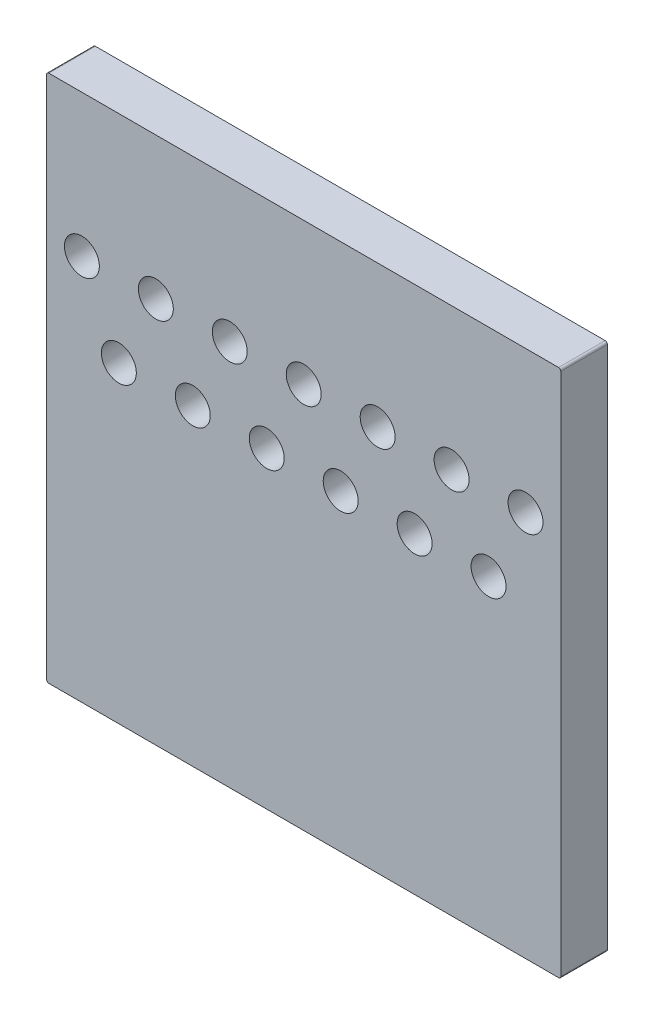
ISO-10303-21;
HEADER;
FILE_DESCRIPTION(('STEP AP214'),'2;1');
FILE_NAME('part.step','',(''),(''),'','','');
FILE_SCHEMA(('AUTOMOTIVE_DESIGN { 1 0 10303 214 1 1 1 1 }'));
ENDSEC;
DATA;
#1=APPLICATION_CONTEXT('core data for automotive mechanical design processes');
#2=APPLICATION_PROTOCOL_DEFINITION('international standard','automotive_design',2000,#1);
#3=PRODUCT_CONTEXT('',#1,'mechanical');
#4=PRODUCT('Part','Part','',(#3));
#5=PRODUCT_RELATED_PRODUCT_CATEGORY('part','',(#4));
#6=PRODUCT_DEFINITION_FORMATION('','',#4);
#7=PRODUCT_DEFINITION_CONTEXT('part definition',#1,'design');
#8=PRODUCT_DEFINITION('design','',#6,#7);
#9=PRODUCT_DEFINITION_SHAPE('','',#8);
#10=(LENGTH_UNIT() NAMED_UNIT(*) SI_UNIT(.MILLI.,.METRE.));
#11=(NAMED_UNIT(*) PLANE_ANGLE_UNIT() SI_UNIT($,.RADIAN.));
#12=(NAMED_UNIT(*) SI_UNIT($,.STERADIAN.) SOLID_ANGLE_UNIT());
#13=UNCERTAINTY_MEASURE_WITH_UNIT(LENGTH_MEASURE(1.E-05),#10,'distance_accuracy_value','');
#14=(GEOMETRIC_REPRESENTATION_CONTEXT(3) GLOBAL_UNCERTAINTY_ASSIGNED_CONTEXT((#13)) GLOBAL_UNIT_ASSIGNED_CONTEXT((#10,
#11,#12)) REPRESENTATION_CONTEXT('',''));
#15=CARTESIAN_POINT('',(0.,0.,0.));
#16=DIRECTION('',(0.,0.,1.));
#17=DIRECTION('',(1.,0.,0.));
#18=AXIS2_PLACEMENT_3D('',#15,#16,#17);
#19=CARTESIAN_POINT('',(28.913000106812,77.287002563477,0.80000094));
#20=DIRECTION('',(0.,0.,1.));
#21=DIRECTION('',(1.,0.,0.));
#22=AXIS2_PLACEMENT_3D('',#19,#20,#21);
#23=PLANE('',#22);
#24=CARTESIAN_POINT('',(35.83092656,83.92519918,0.80000094));
#25=DIRECTION('',(0.,0.,-1.));
#26=DIRECTION('',(-1.,0.,0.));
#27=AXIS2_PLACEMENT_3D('',#24,#25,#26);
#28=CIRCLE('',#27,0.2999994);
#29=CARTESIAN_POINT('',(35.53092716,83.92519918,0.80000094));
#30=VERTEX_POINT('',#29);
#31=EDGE_CURVE('E163',#30,#30,#28,.T.);
#32=ORIENTED_EDGE('',*,*,#31,.T.);
#33=EDGE_LOOP('',(#32));
#34=FACE_BOUND('',#33,.T.);
#35=CARTESIAN_POINT('',(37.10092656,83.92519918,0.80000094));
#36=DIRECTION('',(0.,0.,-1.));
#37=DIRECTION('',(-1.,0.,0.));
#38=AXIS2_PLACEMENT_3D('',#35,#36,#37);
#39=CIRCLE('',#38,0.2999994);
#40=CARTESIAN_POINT('',(36.80092716,83.92519918,0.80000094));
#41=VERTEX_POINT('',#40);
#42=EDGE_CURVE('E166',#41,#41,#39,.T.);
#43=ORIENTED_EDGE('',*,*,#42,.T.);
#44=EDGE_LOOP('',(#43));
#45=FACE_BOUND('',#44,.T.);
#46=CARTESIAN_POINT('',(33.29092656,83.92519918,0.80000094));
#47=DIRECTION('',(0.,0.,-1.));
#48=DIRECTION('',(-1.,0.,0.));
#49=AXIS2_PLACEMENT_3D('',#46,#47,#48);
#50=CIRCLE('',#49,0.2999994);
#51=CARTESIAN_POINT('',(32.99092716,83.92519918,0.80000094));
#52=VERTEX_POINT('',#51);
#53=EDGE_CURVE('E169',#52,#52,#50,.T.);
#54=ORIENTED_EDGE('',*,*,#53,.T.);
#55=EDGE_LOOP('',(#54));
#56=FACE_BOUND('',#55,.T.);
#57=CARTESIAN_POINT('',(34.56092656,83.92519918,0.80000094));
#58=DIRECTION('',(0.,0.,-1.));
#59=DIRECTION('',(-1.,0.,0.));
#60=AXIS2_PLACEMENT_3D('',#57,#58,#59);
#61=CIRCLE('',#60,0.2999994);
#62=CARTESIAN_POINT('',(34.26092716,83.92519918,0.80000094));
#63=VERTEX_POINT('',#62);
#64=EDGE_CURVE('E172',#63,#63,#61,.T.);
#65=ORIENTED_EDGE('',*,*,#64,.T.);
#66=EDGE_LOOP('',(#65));
#67=FACE_BOUND('',#66,.T.);
#68=CARTESIAN_POINT('',(35.19592656,82.65519918,0.80000094));
#69=DIRECTION('',(0.,0.,-1.));
#70=DIRECTION('',(-1.,0.,0.));
#71=AXIS2_PLACEMENT_3D('',#68,#69,#70);
#72=CIRCLE('',#71,0.2999994);
#73=CARTESIAN_POINT('',(34.89592716,82.65519918,0.80000094));
#74=VERTEX_POINT('',#73);
#75=EDGE_CURVE('E175',#74,#74,#72,.T.);
#76=ORIENTED_EDGE('',*,*,#75,.T.);
#77=EDGE_LOOP('',(#76));
#78=FACE_BOUND('',#77,.T.);
#79=CARTESIAN_POINT('',(36.46592656,82.65519918,0.80000094));
#80=DIRECTION('',(0.,0.,-1.));
#81=DIRECTION('',(-1.,0.,0.));
#82=AXIS2_PLACEMENT_3D('',#79,#80,#81);
#83=CIRCLE('',#82,0.2999994);
#84=CARTESIAN_POINT('',(36.16592716,82.65519918,0.80000094));
#85=VERTEX_POINT('',#84);
#86=EDGE_CURVE('E178',#85,#85,#83,.T.);
#87=ORIENTED_EDGE('',*,*,#86,.T.);
#88=EDGE_LOOP('',(#87));
#89=FACE_BOUND('',#88,.T.);
#90=CARTESIAN_POINT('',(33.92592656,82.65519918,0.80000094));
#91=DIRECTION('',(0.,0.,-1.));
#92=DIRECTION('',(-1.,0.,0.));
#93=AXIS2_PLACEMENT_3D('',#90,#91,#92);
#94=CIRCLE('',#93,0.2999994);
#95=CARTESIAN_POINT('',(33.62592716,82.65519918,0.80000094));
#96=VERTEX_POINT('',#95);
#97=EDGE_CURVE('E181',#96,#96,#94,.T.);
#98=ORIENTED_EDGE('',*,*,#97,.T.);
#99=EDGE_LOOP('',(#98));
#100=FACE_BOUND('',#99,.T.);
#101=CARTESIAN_POINT('',(30.75092656,83.92519918,0.80000094));
#102=DIRECTION('',(0.,0.,-1.));
#103=DIRECTION('',(-1.,0.,0.));
#104=AXIS2_PLACEMENT_3D('',#101,#102,#103);
#105=CIRCLE('',#104,0.2999994);
#106=CARTESIAN_POINT('',(30.45092716,83.92519918,0.80000094));
#107=VERTEX_POINT('',#106);
#108=EDGE_CURVE('E184',#107,#107,#105,.T.);
#109=ORIENTED_EDGE('',*,*,#108,.T.);
#110=EDGE_LOOP('',(#109));
#111=FACE_BOUND('',#110,.T.);
#112=CARTESIAN_POINT('',(32.02092656,83.92519918,0.80000094));
#113=DIRECTION('',(0.,0.,-1.));
#114=DIRECTION('',(-1.,0.,0.));
#115=AXIS2_PLACEMENT_3D('',#112,#113,#114);
#116=CIRCLE('',#115,0.2999994);
#117=CARTESIAN_POINT('',(31.72092716,83.92519918,0.80000094));
#118=VERTEX_POINT('',#117);
#119=EDGE_CURVE('E187',#118,#118,#116,.T.);
#120=ORIENTED_EDGE('',*,*,#119,.T.);
#121=EDGE_LOOP('',(#120));
#122=FACE_BOUND('',#121,.T.);
#123=CARTESIAN_POINT('',(29.48092656,83.92519918,0.80000094));
#124=DIRECTION('',(0.,0.,-1.));
#125=DIRECTION('',(-1.,0.,0.));
#126=AXIS2_PLACEMENT_3D('',#123,#124,#125);
#127=CIRCLE('',#126,0.2999994);
#128=CARTESIAN_POINT('',(29.18092716,83.92519918,0.80000094));
#129=VERTEX_POINT('',#128);
#130=EDGE_CURVE('E190',#129,#129,#127,.T.);
#131=ORIENTED_EDGE('',*,*,#130,.T.);
#132=EDGE_LOOP('',(#131));
#133=FACE_BOUND('',#132,.T.);
#134=CARTESIAN_POINT('',(31.38592656,82.65519918,0.80000094));
#135=DIRECTION('',(0.,0.,-1.));
#136=DIRECTION('',(-1.,0.,0.));
#137=AXIS2_PLACEMENT_3D('',#134,#135,#136);
#138=CIRCLE('',#137,0.2999994);
#139=CARTESIAN_POINT('',(31.08592716,82.65519918,0.80000094));
#140=VERTEX_POINT('',#139);
#141=EDGE_CURVE('E193',#140,#140,#138,.T.);
#142=ORIENTED_EDGE('',*,*,#141,.T.);
#143=EDGE_LOOP('',(#142));
#144=FACE_BOUND('',#143,.T.);
#145=CARTESIAN_POINT('',(32.65592656,82.65519918,0.80000094));
#146=DIRECTION('',(0.,0.,-1.));
#147=DIRECTION('',(-1.,0.,0.));
#148=AXIS2_PLACEMENT_3D('',#145,#146,#147);
#149=CIRCLE('',#148,0.2999994);
#150=CARTESIAN_POINT('',(32.35592716,82.65519918,0.80000094));
#151=VERTEX_POINT('',#150);
#152=EDGE_CURVE('E196',#151,#151,#149,.T.);
#153=ORIENTED_EDGE('',*,*,#152,.T.);
#154=EDGE_LOOP('',(#153));
#155=FACE_BOUND('',#154,.T.);
#156=CARTESIAN_POINT('',(30.11592656,82.65519918,0.80000094));
#157=DIRECTION('',(0.,0.,-1.));
#158=DIRECTION('',(-1.,0.,0.));
#159=AXIS2_PLACEMENT_3D('',#156,#157,#158);
#160=CIRCLE('',#159,0.2999994);
#161=CARTESIAN_POINT('',(29.81592716,82.65519918,0.80000094));
#162=VERTEX_POINT('',#161);
#163=EDGE_CURVE('E199',#162,#162,#160,.T.);
#164=ORIENTED_EDGE('',*,*,#163,.T.);
#165=EDGE_LOOP('',(#164));
#166=FACE_BOUND('',#165,.T.);
#167=DIRECTION('',(0.,1.,0.));
#168=VECTOR('',#167,1.);
#169=CARTESIAN_POINT('',(28.875,77.324996948242,0.80000094));
#170=LINE('',#169,#168);
#171=CARTESIAN_POINT('',(28.8749999999997,77.324996948242,0.80000094));
#172=VERTEX_POINT('',#171);
#173=CARTESIAN_POINT('',(28.875,86.324996948242,0.80000094));
#174=VERTEX_POINT('',#173);
#175=EDGE_CURVE('E107',#172,#174,#170,.T.);
#176=ORIENTED_EDGE('',*,*,#175,.F.);
#177=CARTESIAN_POINT('',(28.912551896545,77.324554392951,0.80000094));
#178=DIRECTION('',(0.,0.,-1.));
#179=DIRECTION('',(-1.,0.,0.));
#180=AXIS2_PLACEMENT_3D('',#177,#178,#179);
#181=CIRCLE('',#180,0.03755450424843);
#182=CARTESIAN_POINT('',(28.913000106812,77.2870025634766,0.80000094));
#183=VERTEX_POINT('',#182);
#184=EDGE_CURVE('E94',#183,#172,#181,.T.);
#185=ORIENTED_EDGE('',*,*,#184,.F.);
#186=DIRECTION('',(1.,0.,0.));
#187=VECTOR('',#186,1.);
#188=CARTESIAN_POINT('',(37.667999267578,77.287002563477,0.80000094));
#189=LINE('',#188,#187);
#190=CARTESIAN_POINT('',(37.6679992675684,77.2870025634766,0.80000094));
#191=VERTEX_POINT('',#190);
#192=EDGE_CURVE('E91',#191,#183,#189,.F.);
#193=ORIENTED_EDGE('',*,*,#192,.F.);
#194=CARTESIAN_POINT('',(37.669405407789,77.324573963767,0.80000094));
#195=DIRECTION('',(0.,0.,-1.));
#196=DIRECTION('',(-1.,0.,0.));
#197=AXIS2_PLACEMENT_3D('',#194,#195,#196);
#198=CIRCLE('',#197,0.03759770405353);
#199=CARTESIAN_POINT('',(37.707000732422,77.324996948242,0.80000094));
#200=VERTEX_POINT('',#199);
#201=EDGE_CURVE('E19',#200,#191,#198,.T.);
#202=ORIENTED_EDGE('',*,*,#201,.F.);
#203=DIRECTION('',(0.,1.,0.));
#204=VECTOR('',#203,1.);
#205=CARTESIAN_POINT('',(37.707000732422,86.324996948242,0.80000094));
#206=LINE('',#205,#204);
#207=CARTESIAN_POINT('',(37.7070007324218,86.324996948242,0.80000094));
#208=VERTEX_POINT('',#207);
#209=EDGE_CURVE('E78',#208,#200,#206,.F.);
#210=ORIENTED_EDGE('',*,*,#209,.F.);
#211=CARTESIAN_POINT('',(37.667746185972,86.324743866636,0.80000094));
#212=DIRECTION('',(0.,0.,-1.));
#213=DIRECTION('',(-1.,0.,0.));
#214=AXIS2_PLACEMENT_3D('',#211,#212,#213);
#215=CIRCLE('',#214,0.0392553622741);
#216=CARTESIAN_POINT('',(37.667999267578,86.363998413086,0.80000094));
#217=VERTEX_POINT('',#216);
#218=EDGE_CURVE('E205',#217,#208,#215,.T.);
#219=ORIENTED_EDGE('',*,*,#218,.F.);
#220=DIRECTION('',(1.,0.,0.));
#221=VECTOR('',#220,1.);
#222=CARTESIAN_POINT('',(28.913000106812,86.363998413086,0.80000094));
#223=LINE('',#222,#221);
#224=CARTESIAN_POINT('',(28.9130001068087,86.3639984130861,0.80000094));
#225=VERTEX_POINT('',#224);
#226=EDGE_CURVE('E111',#225,#217,#223,.T.);
#227=ORIENTED_EDGE('',*,*,#226,.F.);
#228=CARTESIAN_POINT('',(28.914285161577,86.324733390264,0.80000094));
#229=DIRECTION('',(0.,0.,-1.));
#230=DIRECTION('',(-1.,0.,0.));
#231=AXIS2_PLACEMENT_3D('',#228,#229,#230);
#232=CIRCLE('',#231,0.03928604565208);
#233=EDGE_CURVE('E204',#174,#225,#232,.T.);
#234=ORIENTED_EDGE('',*,*,#233,.F.);
#235=EDGE_LOOP('',(#176,#185,#193,#202,#210,#219,#227,#234));
#236=FACE_BOUND('',#235,.T.);
#237=ADVANCED_FACE('F16',(#34,#45,#56,#67,#78,#89,#100,#111,#122,#133,#144,#155,#166,#236),#23,.T.);
#238=CARTESIAN_POINT('',(37.667999267578,77.287002563477,0.));
#239=DIRECTION('',(0.,-1.,0.));
#240=DIRECTION('',(0.,0.,-1.));
#241=AXIS2_PLACEMENT_3D('',#238,#239,#240);
#242=PLANE('',#241);
#243=DIRECTION('',(0.,0.,-1.));
#244=VECTOR('',#243,1.);
#245=CARTESIAN_POINT('',(28.913000106812,77.2870025634762,0.));
#246=LINE('',#245,#244);
#247=CARTESIAN_POINT('',(28.913000106812,77.2870025634766,0.));
#248=VERTEX_POINT('',#247);
#249=EDGE_CURVE('E203',#248,#183,#246,.F.);
#250=ORIENTED_EDGE('',*,*,#249,.F.);
#251=DIRECTION('',(1.,0.,0.));
#252=VECTOR('',#251,1.);
#253=CARTESIAN_POINT('',(28.913000106812,77.287002563477,0.));
#254=LINE('',#253,#252);
#255=CARTESIAN_POINT('',(37.6679992675684,77.2870025634766,0.));
#256=VERTEX_POINT('',#255);
#257=EDGE_CURVE('E101',#248,#256,#254,.T.);
#258=ORIENTED_EDGE('',*,*,#257,.T.);
#259=DIRECTION('',(0.,0.,-1.));
#260=VECTOR('',#259,1.);
#261=CARTESIAN_POINT('',(37.667999267578,77.2870025634763,0.));
#262=LINE('',#261,#260);
#263=EDGE_CURVE('E87',#191,#256,#262,.T.);
#264=ORIENTED_EDGE('',*,*,#263,.F.);
#265=ORIENTED_EDGE('',*,*,#192,.T.);
#266=EDGE_LOOP('',(#250,#258,#264,#265));
#267=FACE_BOUND('',#266,.T.);
#268=ADVANCED_FACE('F100',(#267),#242,.T.);
#269=CARTESIAN_POINT('',(37.669405407789,77.324573963767,0.));
#270=DIRECTION('',(0.,0.,-1.));
#271=DIRECTION('',(-1.,0.,0.));
#272=AXIS2_PLACEMENT_3D('',#269,#270,#271);
#273=CYLINDRICAL_SURFACE('',#272,0.03759770405353);
#274=ORIENTED_EDGE('',*,*,#263,.T.);
#275=CARTESIAN_POINT('',(37.669405407789,77.324573963767,0.));
#276=DIRECTION('',(0.,0.,-1.));
#277=DIRECTION('',(-1.,0.,0.));
#278=AXIS2_PLACEMENT_3D('',#275,#276,#277);
#279=CIRCLE('',#278,0.03759770405353);
#280=CARTESIAN_POINT('',(37.707000732422,77.324996948242,0.));
#281=VERTEX_POINT('',#280);
#282=EDGE_CURVE('E161',#256,#281,#279,.F.);
#283=ORIENTED_EDGE('',*,*,#282,.T.);
#284=DIRECTION('',(0.,0.,-1.));
#285=VECTOR('',#284,1.);
#286=CARTESIAN_POINT('',(37.707000732422,77.324996948242,0.));
#287=LINE('',#286,#285);
#288=EDGE_CURVE('E89',#200,#281,#287,.T.);
#289=ORIENTED_EDGE('',*,*,#288,.F.);
#290=ORIENTED_EDGE('',*,*,#201,.T.);
#291=EDGE_LOOP('',(#274,#283,#289,#290));
#292=FACE_BOUND('',#291,.T.);
#293=ADVANCED_FACE('F84',(#292),#273,.T.);
#294=CARTESIAN_POINT('',(37.707000732422,86.324996948242,0.));
#295=DIRECTION('',(1.,0.,0.));
#296=DIRECTION('',(0.,0.,-1.));
#297=AXIS2_PLACEMENT_3D('',#294,#295,#296);
#298=PLANE('',#297);
#299=ORIENTED_EDGE('',*,*,#288,.T.);
#300=DIRECTION('',(0.,1.,0.));
#301=VECTOR('',#300,1.);
#302=CARTESIAN_POINT('',(37.707000732422,77.287002563477,0.));
#303=LINE('',#302,#301);
#304=CARTESIAN_POINT('',(37.7070007324218,86.324996948242,0.));
#305=VERTEX_POINT('',#304);
#306=EDGE_CURVE('E160',#281,#305,#303,.T.);
#307=ORIENTED_EDGE('',*,*,#306,.T.);
#308=DIRECTION('',(0.,0.,-1.));
#309=VECTOR('',#308,1.);
#310=CARTESIAN_POINT('',(37.7070007324217,86.324996948242,0.));
#311=LINE('',#310,#309);
#312=EDGE_CURVE('E113',#208,#305,#311,.T.);
#313=ORIENTED_EDGE('',*,*,#312,.F.);
#314=ORIENTED_EDGE('',*,*,#209,.T.);
#315=EDGE_LOOP('',(#299,#307,#313,#314));
#316=FACE_BOUND('',#315,.T.);
#317=ADVANCED_FACE('F211',(#316),#298,.T.);
#318=CARTESIAN_POINT('',(37.667746185972,86.324743866636,0.));
#319=DIRECTION('',(0.,0.,-1.));
#320=DIRECTION('',(-1.,0.,0.));
#321=AXIS2_PLACEMENT_3D('',#318,#319,#320);
#322=CYLINDRICAL_SURFACE('',#321,0.0392553622741);
#323=ORIENTED_EDGE('',*,*,#312,.T.);
#324=CARTESIAN_POINT('',(37.667746185972,86.324743866636,0.));
#325=DIRECTION('',(0.,0.,-1.));
#326=DIRECTION('',(-1.,0.,0.));
#327=AXIS2_PLACEMENT_3D('',#324,#325,#326);
#328=CIRCLE('',#327,0.0392553622741);
#329=CARTESIAN_POINT('',(37.667999267578,86.363998413086,0.));
#330=VERTEX_POINT('',#329);
#331=EDGE_CURVE('E157',#305,#330,#328,.F.);
#332=ORIENTED_EDGE('',*,*,#331,.T.);
#333=DIRECTION('',(0.,0.,1.));
#334=VECTOR('',#333,1.);
#335=CARTESIAN_POINT('',(37.667999267578,86.363998413086,0.));
#336=LINE('',#335,#334);
#337=EDGE_CURVE('E112',#217,#330,#336,.F.);
#338=ORIENTED_EDGE('',*,*,#337,.F.);
#339=ORIENTED_EDGE('',*,*,#218,.T.);
#340=EDGE_LOOP('',(#323,#332,#338,#339));
#341=FACE_BOUND('',#340,.T.);
#342=ADVANCED_FACE('F232',(#341),#322,.T.);
#343=CARTESIAN_POINT('',(28.913000106812,86.363998413086,0.));
#344=DIRECTION('',(0.,1.,0.));
#345=DIRECTION('',(0.,0.,1.));
#346=AXIS2_PLACEMENT_3D('',#343,#344,#345);
#347=PLANE('',#346);
#348=ORIENTED_EDGE('',*,*,#337,.T.);
#349=DIRECTION('',(1.,0.,0.));
#350=VECTOR('',#349,1.);
#351=CARTESIAN_POINT('',(28.913000106812,86.363998413086,0.));
#352=LINE('',#351,#350);
#353=CARTESIAN_POINT('',(28.9130001068087,86.3639984130861,0.));
#354=VERTEX_POINT('',#353);
#355=EDGE_CURVE('E156',#330,#354,#352,.F.);
#356=ORIENTED_EDGE('',*,*,#355,.T.);
#357=DIRECTION('',(0.,0.,-1.));
#358=VECTOR('',#357,1.);
#359=CARTESIAN_POINT('',(28.913000106812,86.3639984130862,0.));
#360=LINE('',#359,#358);
#361=EDGE_CURVE('E109',#225,#354,#360,.T.);
#362=ORIENTED_EDGE('',*,*,#361,.F.);
#363=ORIENTED_EDGE('',*,*,#226,.T.);
#364=EDGE_LOOP('',(#348,#356,#362,#363));
#365=FACE_BOUND('',#364,.T.);
#366=ADVANCED_FACE('F228',(#365),#347,.T.);
#367=CARTESIAN_POINT('',(28.914285161577,86.324733390264,0.));
#368=DIRECTION('',(0.,0.,-1.));
#369=DIRECTION('',(-1.,0.,0.));
#370=AXIS2_PLACEMENT_3D('',#367,#368,#369);
#371=CYLINDRICAL_SURFACE('',#370,0.03928604565208);
#372=ORIENTED_EDGE('',*,*,#361,.T.);
#373=CARTESIAN_POINT('',(28.914285161577,86.324733390264,0.));
#374=DIRECTION('',(0.,0.,-1.));
#375=DIRECTION('',(-1.,0.,0.));
#376=AXIS2_PLACEMENT_3D('',#373,#374,#375);
#377=CIRCLE('',#376,0.03928604565208);
#378=CARTESIAN_POINT('',(28.875,86.324996948242,0.));
#379=VERTEX_POINT('',#378);
#380=EDGE_CURVE('E153',#354,#379,#377,.F.);
#381=ORIENTED_EDGE('',*,*,#380,.T.);
#382=DIRECTION('',(0.,0.,1.));
#383=VECTOR('',#382,1.);
#384=CARTESIAN_POINT('',(28.875,86.324996948242,0.));
#385=LINE('',#384,#383);
#386=EDGE_CURVE('E108',#174,#379,#385,.F.);
#387=ORIENTED_EDGE('',*,*,#386,.F.);
#388=ORIENTED_EDGE('',*,*,#233,.T.);
#389=EDGE_LOOP('',(#372,#381,#387,#388));
#390=FACE_BOUND('',#389,.T.);
#391=ADVANCED_FACE('F240',(#390),#371,.T.);
#392=CARTESIAN_POINT('',(28.875,77.324996948242,0.));
#393=DIRECTION('',(-1.,0.,0.));
#394=DIRECTION('',(0.,0.,1.));
#395=AXIS2_PLACEMENT_3D('',#392,#393,#394);
#396=PLANE('',#395);
#397=ORIENTED_EDGE('',*,*,#386,.T.);
#398=DIRECTION('',(0.,1.,0.));
#399=VECTOR('',#398,1.);
#400=CARTESIAN_POINT('',(28.875,77.287002563477,0.));
#401=LINE('',#400,#399);
#402=CARTESIAN_POINT('',(28.8749999999997,77.324996948242,0.));
#403=VERTEX_POINT('',#402);
#404=EDGE_CURVE('E152',#379,#403,#401,.F.);
#405=ORIENTED_EDGE('',*,*,#404,.T.);
#406=DIRECTION('',(0.,0.,-1.));
#407=VECTOR('',#406,1.);
#408=CARTESIAN_POINT('',(28.8749999999996,77.324996948242,0.));
#409=LINE('',#408,#407);
#410=EDGE_CURVE('E34',#172,#403,#409,.T.);
#411=ORIENTED_EDGE('',*,*,#410,.F.);
#412=ORIENTED_EDGE('',*,*,#175,.T.);
#413=EDGE_LOOP('',(#397,#405,#411,#412));
#414=FACE_BOUND('',#413,.T.);
#415=ADVANCED_FACE('F306',(#414),#396,.T.);
#416=CARTESIAN_POINT('',(28.912551896545,77.324554392951,0.));
#417=DIRECTION('',(0.,0.,-1.));
#418=DIRECTION('',(-1.,0.,0.));
#419=AXIS2_PLACEMENT_3D('',#416,#417,#418);
#420=CYLINDRICAL_SURFACE('',#419,0.03755450424843);
#421=ORIENTED_EDGE('',*,*,#410,.T.);
#422=CARTESIAN_POINT('',(28.912551896545,77.324554392951,0.));
#423=DIRECTION('',(0.,0.,-1.));
#424=DIRECTION('',(-1.,0.,0.));
#425=AXIS2_PLACEMENT_3D('',#422,#423,#424);
#426=CIRCLE('',#425,0.03755450424843);
#427=EDGE_CURVE('E150',#403,#248,#426,.F.);
#428=ORIENTED_EDGE('',*,*,#427,.T.);
#429=ORIENTED_EDGE('',*,*,#249,.T.);
#430=ORIENTED_EDGE('',*,*,#184,.T.);
#431=EDGE_LOOP('',(#421,#428,#429,#430));
#432=FACE_BOUND('',#431,.T.);
#433=ADVANCED_FACE('F302',(#432),#420,.T.);
#434=CARTESIAN_POINT('',(30.11592656,82.65519918,0.));
#435=DIRECTION('',(0.,0.,-1.));
#436=DIRECTION('',(-1.,0.,0.));
#437=AXIS2_PLACEMENT_3D('',#434,#435,#436);
#438=CYLINDRICAL_SURFACE('',#437,0.2999994);
#439=ORIENTED_EDGE('',*,*,#163,.F.);
#440=EDGE_LOOP('',(#439));
#441=FACE_BOUND('',#440,.T.);
#442=CARTESIAN_POINT('',(30.11592656,82.65519918,0.));
#443=DIRECTION('',(0.,0.,-1.));
#444=DIRECTION('',(-1.,0.,0.));
#445=AXIS2_PLACEMENT_3D('',#442,#443,#444);
#446=CIRCLE('',#445,0.2999994);
#447=CARTESIAN_POINT('',(29.81592716,82.65519918,0.));
#448=VERTEX_POINT('',#447);
#449=EDGE_CURVE('E147',#448,#448,#446,.T.);
#450=ORIENTED_EDGE('',*,*,#449,.T.);
#451=EDGE_LOOP('',(#450));
#452=FACE_BOUND('',#451,.T.);
#453=ADVANCED_FACE('F298',(#441,#452),#438,.F.);
#454=CARTESIAN_POINT('',(32.65592656,82.65519918,0.));
#455=DIRECTION('',(0.,0.,-1.));
#456=DIRECTION('',(-1.,0.,0.));
#457=AXIS2_PLACEMENT_3D('',#454,#455,#456);
#458=CYLINDRICAL_SURFACE('',#457,0.2999994);
#459=ORIENTED_EDGE('',*,*,#152,.F.);
#460=EDGE_LOOP('',(#459));
#461=FACE_BOUND('',#460,.T.);
#462=CARTESIAN_POINT('',(32.65592656,82.65519918,0.));
#463=DIRECTION('',(0.,0.,-1.));
#464=DIRECTION('',(-1.,0.,0.));
#465=AXIS2_PLACEMENT_3D('',#462,#463,#464);
#466=CIRCLE('',#465,0.2999994);
#467=CARTESIAN_POINT('',(32.35592716,82.65519918,0.));
#468=VERTEX_POINT('',#467);
#469=EDGE_CURVE('E144',#468,#468,#466,.T.);
#470=ORIENTED_EDGE('',*,*,#469,.T.);
#471=EDGE_LOOP('',(#470));
#472=FACE_BOUND('',#471,.T.);
#473=ADVANCED_FACE('F294',(#461,#472),#458,.F.);
#474=CARTESIAN_POINT('',(31.38592656,82.65519918,0.));
#475=DIRECTION('',(0.,0.,-1.));
#476=DIRECTION('',(-1.,0.,0.));
#477=AXIS2_PLACEMENT_3D('',#474,#475,#476);
#478=CYLINDRICAL_SURFACE('',#477,0.2999994);
#479=ORIENTED_EDGE('',*,*,#141,.F.);
#480=EDGE_LOOP('',(#479));
#481=FACE_BOUND('',#480,.T.);
#482=CARTESIAN_POINT('',(31.38592656,82.65519918,0.));
#483=DIRECTION('',(0.,0.,-1.));
#484=DIRECTION('',(-1.,0.,0.));
#485=AXIS2_PLACEMENT_3D('',#482,#483,#484);
#486=CIRCLE('',#485,0.2999994);
#487=CARTESIAN_POINT('',(31.08592716,82.65519918,0.));
#488=VERTEX_POINT('',#487);
#489=EDGE_CURVE('E141',#488,#488,#486,.T.);
#490=ORIENTED_EDGE('',*,*,#489,.T.);
#491=EDGE_LOOP('',(#490));
#492=FACE_BOUND('',#491,.T.);
#493=ADVANCED_FACE('F290',(#481,#492),#478,.F.);
#494=CARTESIAN_POINT('',(29.48092656,83.92519918,0.));
#495=DIRECTION('',(0.,0.,-1.));
#496=DIRECTION('',(-1.,0.,0.));
#497=AXIS2_PLACEMENT_3D('',#494,#495,#496);
#498=CYLINDRICAL_SURFACE('',#497,0.2999994);
#499=ORIENTED_EDGE('',*,*,#130,.F.);
#500=EDGE_LOOP('',(#499));
#501=FACE_BOUND('',#500,.T.);
#502=CARTESIAN_POINT('',(29.48092656,83.92519918,0.));
#503=DIRECTION('',(0.,0.,-1.));
#504=DIRECTION('',(-1.,0.,0.));
#505=AXIS2_PLACEMENT_3D('',#502,#503,#504);
#506=CIRCLE('',#505,0.2999994);
#507=CARTESIAN_POINT('',(29.18092716,83.92519918,0.));
#508=VERTEX_POINT('',#507);
#509=EDGE_CURVE('E138',#508,#508,#506,.T.);
#510=ORIENTED_EDGE('',*,*,#509,.T.);
#511=EDGE_LOOP('',(#510));
#512=FACE_BOUND('',#511,.T.);
#513=ADVANCED_FACE('F286',(#501,#512),#498,.F.);
#514=CARTESIAN_POINT('',(32.02092656,83.92519918,0.));
#515=DIRECTION('',(0.,0.,-1.));
#516=DIRECTION('',(-1.,0.,0.));
#517=AXIS2_PLACEMENT_3D('',#514,#515,#516);
#518=CYLINDRICAL_SURFACE('',#517,0.2999994);
#519=ORIENTED_EDGE('',*,*,#119,.F.);
#520=EDGE_LOOP('',(#519));
#521=FACE_BOUND('',#520,.T.);
#522=CARTESIAN_POINT('',(32.02092656,83.92519918,0.));
#523=DIRECTION('',(0.,0.,-1.));
#524=DIRECTION('',(-1.,0.,0.));
#525=AXIS2_PLACEMENT_3D('',#522,#523,#524);
#526=CIRCLE('',#525,0.2999994);
#527=CARTESIAN_POINT('',(31.72092716,83.92519918,0.));
#528=VERTEX_POINT('',#527);
#529=EDGE_CURVE('E135',#528,#528,#526,.T.);
#530=ORIENTED_EDGE('',*,*,#529,.T.);
#531=EDGE_LOOP('',(#530));
#532=FACE_BOUND('',#531,.T.);
#533=ADVANCED_FACE('F282',(#521,#532),#518,.F.);
#534=CARTESIAN_POINT('',(30.75092656,83.92519918,0.));
#535=DIRECTION('',(0.,0.,-1.));
#536=DIRECTION('',(-1.,0.,0.));
#537=AXIS2_PLACEMENT_3D('',#534,#535,#536);
#538=CYLINDRICAL_SURFACE('',#537,0.2999994);
#539=ORIENTED_EDGE('',*,*,#108,.F.);
#540=EDGE_LOOP('',(#539));
#541=FACE_BOUND('',#540,.T.);
#542=CARTESIAN_POINT('',(30.75092656,83.92519918,0.));
#543=DIRECTION('',(0.,0.,-1.));
#544=DIRECTION('',(-1.,0.,0.));
#545=AXIS2_PLACEMENT_3D('',#542,#543,#544);
#546=CIRCLE('',#545,0.2999994);
#547=CARTESIAN_POINT('',(30.45092716,83.92519918,0.));
#548=VERTEX_POINT('',#547);
#549=EDGE_CURVE('E132',#548,#548,#546,.T.);
#550=ORIENTED_EDGE('',*,*,#549,.T.);
#551=EDGE_LOOP('',(#550));
#552=FACE_BOUND('',#551,.T.);
#553=ADVANCED_FACE('F278',(#541,#552),#538,.F.);
#554=CARTESIAN_POINT('',(33.92592656,82.65519918,0.));
#555=DIRECTION('',(0.,0.,-1.));
#556=DIRECTION('',(-1.,0.,0.));
#557=AXIS2_PLACEMENT_3D('',#554,#555,#556);
#558=CYLINDRICAL_SURFACE('',#557,0.2999994);
#559=ORIENTED_EDGE('',*,*,#97,.F.);
#560=EDGE_LOOP('',(#559));
#561=FACE_BOUND('',#560,.T.);
#562=CARTESIAN_POINT('',(33.92592656,82.65519918,0.));
#563=DIRECTION('',(0.,0.,-1.));
#564=DIRECTION('',(-1.,0.,0.));
#565=AXIS2_PLACEMENT_3D('',#562,#563,#564);
#566=CIRCLE('',#565,0.2999994);
#567=CARTESIAN_POINT('',(33.62592716,82.65519918,0.));
#568=VERTEX_POINT('',#567);
#569=EDGE_CURVE('E129',#568,#568,#566,.T.);
#570=ORIENTED_EDGE('',*,*,#569,.T.);
#571=EDGE_LOOP('',(#570));
#572=FACE_BOUND('',#571,.T.);
#573=ADVANCED_FACE('F274',(#561,#572),#558,.F.);
#574=CARTESIAN_POINT('',(36.46592656,82.65519918,0.));
#575=DIRECTION('',(0.,0.,-1.));
#576=DIRECTION('',(-1.,0.,0.));
#577=AXIS2_PLACEMENT_3D('',#574,#575,#576);
#578=CYLINDRICAL_SURFACE('',#577,0.2999994);
#579=ORIENTED_EDGE('',*,*,#86,.F.);
#580=EDGE_LOOP('',(#579));
#581=FACE_BOUND('',#580,.T.);
#582=CARTESIAN_POINT('',(36.46592656,82.65519918,0.));
#583=DIRECTION('',(0.,0.,-1.));
#584=DIRECTION('',(-1.,0.,0.));
#585=AXIS2_PLACEMENT_3D('',#582,#583,#584);
#586=CIRCLE('',#585,0.2999994);
#587=CARTESIAN_POINT('',(36.16592716,82.65519918,0.));
#588=VERTEX_POINT('',#587);
#589=EDGE_CURVE('E126',#588,#588,#586,.T.);
#590=ORIENTED_EDGE('',*,*,#589,.T.);
#591=EDGE_LOOP('',(#590));
#592=FACE_BOUND('',#591,.T.);
#593=ADVANCED_FACE('F270',(#581,#592),#578,.F.);
#594=CARTESIAN_POINT('',(35.19592656,82.65519918,0.));
#595=DIRECTION('',(0.,0.,-1.));
#596=DIRECTION('',(-1.,0.,0.));
#597=AXIS2_PLACEMENT_3D('',#594,#595,#596);
#598=CYLINDRICAL_SURFACE('',#597,0.2999994);
#599=ORIENTED_EDGE('',*,*,#75,.F.);
#600=EDGE_LOOP('',(#599));
#601=FACE_BOUND('',#600,.T.);
#602=CARTESIAN_POINT('',(35.19592656,82.65519918,0.));
#603=DIRECTION('',(0.,0.,-1.));
#604=DIRECTION('',(-1.,0.,0.));
#605=AXIS2_PLACEMENT_3D('',#602,#603,#604);
#606=CIRCLE('',#605,0.2999994);
#607=CARTESIAN_POINT('',(34.89592716,82.65519918,0.));
#608=VERTEX_POINT('',#607);
#609=EDGE_CURVE('E123',#608,#608,#606,.T.);
#610=ORIENTED_EDGE('',*,*,#609,.T.);
#611=EDGE_LOOP('',(#610));
#612=FACE_BOUND('',#611,.T.);
#613=ADVANCED_FACE('F266',(#601,#612),#598,.F.);
#614=CARTESIAN_POINT('',(34.56092656,83.92519918,0.));
#615=DIRECTION('',(0.,0.,-1.));
#616=DIRECTION('',(-1.,0.,0.));
#617=AXIS2_PLACEMENT_3D('',#614,#615,#616);
#618=CYLINDRICAL_SURFACE('',#617,0.2999994);
#619=ORIENTED_EDGE('',*,*,#64,.F.);
#620=EDGE_LOOP('',(#619));
#621=FACE_BOUND('',#620,.T.);
#622=CARTESIAN_POINT('',(34.56092656,83.92519918,0.));
#623=DIRECTION('',(0.,0.,-1.));
#624=DIRECTION('',(-1.,0.,0.));
#625=AXIS2_PLACEMENT_3D('',#622,#623,#624);
#626=CIRCLE('',#625,0.2999994);
#627=CARTESIAN_POINT('',(34.26092716,83.92519918,0.));
#628=VERTEX_POINT('',#627);
#629=EDGE_CURVE('E120',#628,#628,#626,.T.);
#630=ORIENTED_EDGE('',*,*,#629,.T.);
#631=EDGE_LOOP('',(#630));
#632=FACE_BOUND('',#631,.T.);
#633=ADVANCED_FACE('F262',(#621,#632),#618,.F.);
#634=CARTESIAN_POINT('',(33.29092656,83.92519918,0.));
#635=DIRECTION('',(0.,0.,-1.));
#636=DIRECTION('',(-1.,0.,0.));
#637=AXIS2_PLACEMENT_3D('',#634,#635,#636);
#638=CYLINDRICAL_SURFACE('',#637,0.2999994);
#639=ORIENTED_EDGE('',*,*,#53,.F.);
#640=EDGE_LOOP('',(#639));
#641=FACE_BOUND('',#640,.T.);
#642=CARTESIAN_POINT('',(33.29092656,83.92519918,0.));
#643=DIRECTION('',(0.,0.,-1.));
#644=DIRECTION('',(-1.,0.,0.));
#645=AXIS2_PLACEMENT_3D('',#642,#643,#644);
#646=CIRCLE('',#645,0.2999994);
#647=CARTESIAN_POINT('',(32.99092716,83.92519918,0.));
#648=VERTEX_POINT('',#647);
#649=EDGE_CURVE('E117',#648,#648,#646,.T.);
#650=ORIENTED_EDGE('',*,*,#649,.T.);
#651=EDGE_LOOP('',(#650));
#652=FACE_BOUND('',#651,.T.);
#653=ADVANCED_FACE('F258',(#641,#652),#638,.F.);
#654=CARTESIAN_POINT('',(37.10092656,83.92519918,0.));
#655=DIRECTION('',(0.,0.,-1.));
#656=DIRECTION('',(-1.,0.,0.));
#657=AXIS2_PLACEMENT_3D('',#654,#655,#656);
#658=CYLINDRICAL_SURFACE('',#657,0.2999994);
#659=ORIENTED_EDGE('',*,*,#42,.F.);
#660=EDGE_LOOP('',(#659));
#661=FACE_BOUND('',#660,.T.);
#662=CARTESIAN_POINT('',(37.10092656,83.92519918,0.));
#663=DIRECTION('',(0.,0.,-1.));
#664=DIRECTION('',(-1.,0.,0.));
#665=AXIS2_PLACEMENT_3D('',#662,#663,#664);
#666=CIRCLE('',#665,0.2999994);
#667=CARTESIAN_POINT('',(36.80092716,83.92519918,0.));
#668=VERTEX_POINT('',#667);
#669=EDGE_CURVE('E25',#668,#668,#666,.T.);
#670=ORIENTED_EDGE('',*,*,#669,.T.);
#671=EDGE_LOOP('',(#670));
#672=FACE_BOUND('',#671,.T.);
#673=ADVANCED_FACE('F250',(#661,#672),#658,.F.);
#674=CARTESIAN_POINT('',(35.83092656,83.92519918,0.));
#675=DIRECTION('',(0.,0.,-1.));
#676=DIRECTION('',(-1.,0.,0.));
#677=AXIS2_PLACEMENT_3D('',#674,#675,#676);
#678=CYLINDRICAL_SURFACE('',#677,0.2999994);
#679=ORIENTED_EDGE('',*,*,#31,.F.);
#680=EDGE_LOOP('',(#679));
#681=FACE_BOUND('',#680,.T.);
#682=CARTESIAN_POINT('',(35.83092656,83.92519918,0.));
#683=DIRECTION('',(0.,0.,-1.));
#684=DIRECTION('',(-1.,0.,0.));
#685=AXIS2_PLACEMENT_3D('',#682,#683,#684);
#686=CIRCLE('',#685,0.2999994);
#687=CARTESIAN_POINT('',(35.53092716,83.92519918,0.));
#688=VERTEX_POINT('',#687);
#689=EDGE_CURVE('E11',#688,#688,#686,.T.);
#690=ORIENTED_EDGE('',*,*,#689,.T.);
#691=EDGE_LOOP('',(#690));
#692=FACE_BOUND('',#691,.T.);
#693=ADVANCED_FACE('F244',(#681,#692),#678,.F.);
#694=CARTESIAN_POINT('',(28.913000106812,77.287002563477,0.));
#695=DIRECTION('',(0.,0.,1.));
#696=DIRECTION('',(1.,0.,0.));
#697=AXIS2_PLACEMENT_3D('',#694,#695,#696);
#698=PLANE('',#697);
#699=ORIENTED_EDGE('',*,*,#689,.F.);
#700=EDGE_LOOP('',(#699));
#701=FACE_BOUND('',#700,.T.);
#702=ORIENTED_EDGE('',*,*,#669,.F.);
#703=EDGE_LOOP('',(#702));
#704=FACE_BOUND('',#703,.T.);
#705=ORIENTED_EDGE('',*,*,#649,.F.);
#706=EDGE_LOOP('',(#705));
#707=FACE_BOUND('',#706,.T.);
#708=ORIENTED_EDGE('',*,*,#629,.F.);
#709=EDGE_LOOP('',(#708));
#710=FACE_BOUND('',#709,.T.);
#711=ORIENTED_EDGE('',*,*,#609,.F.);
#712=EDGE_LOOP('',(#711));
#713=FACE_BOUND('',#712,.T.);
#714=ORIENTED_EDGE('',*,*,#589,.F.);
#715=EDGE_LOOP('',(#714));
#716=FACE_BOUND('',#715,.T.);
#717=ORIENTED_EDGE('',*,*,#569,.F.);
#718=EDGE_LOOP('',(#717));
#719=FACE_BOUND('',#718,.T.);
#720=ORIENTED_EDGE('',*,*,#549,.F.);
#721=EDGE_LOOP('',(#720));
#722=FACE_BOUND('',#721,.T.);
#723=ORIENTED_EDGE('',*,*,#529,.F.);
#724=EDGE_LOOP('',(#723));
#725=FACE_BOUND('',#724,.T.);
#726=ORIENTED_EDGE('',*,*,#509,.F.);
#727=EDGE_LOOP('',(#726));
#728=FACE_BOUND('',#727,.T.);
#729=ORIENTED_EDGE('',*,*,#489,.F.);
#730=EDGE_LOOP('',(#729));
#731=FACE_BOUND('',#730,.T.);
#732=ORIENTED_EDGE('',*,*,#469,.F.);
#733=EDGE_LOOP('',(#732));
#734=FACE_BOUND('',#733,.T.);
#735=ORIENTED_EDGE('',*,*,#449,.F.);
#736=EDGE_LOOP('',(#735));
#737=FACE_BOUND('',#736,.T.);
#738=ORIENTED_EDGE('',*,*,#404,.F.);
#739=ORIENTED_EDGE('',*,*,#380,.F.);
#740=ORIENTED_EDGE('',*,*,#355,.F.);
#741=ORIENTED_EDGE('',*,*,#331,.F.);
#742=ORIENTED_EDGE('',*,*,#306,.F.);
#743=ORIENTED_EDGE('',*,*,#282,.F.);
#744=ORIENTED_EDGE('',*,*,#257,.F.);
#745=ORIENTED_EDGE('',*,*,#427,.F.);
#746=EDGE_LOOP('',(#738,#739,#740,#741,#742,#743,#744,#745));
#747=FACE_BOUND('',#746,.T.);
#748=ADVANCED_FACE('F215',(#701,#704,#707,#710,#713,#716,#719,#722,#725,#728,#731,#734,#737,
#747),#698,.F.);
#749=CLOSED_SHELL('',(#237,#268,#293,#317,#342,#366,#391,#415,#433,#453,#473,#493,#513,#533,
#553,#573,#593,#613,#633,#653,#673,#693,#748));
#750=MANIFOLD_SOLID_BREP('B1',#749);
#751=ADVANCED_BREP_SHAPE_REPRESENTATION('',(#18,#750),#14);
#752=SHAPE_DEFINITION_REPRESENTATION(#9,#751);
ENDSEC;
END-ISO-10303-21;
